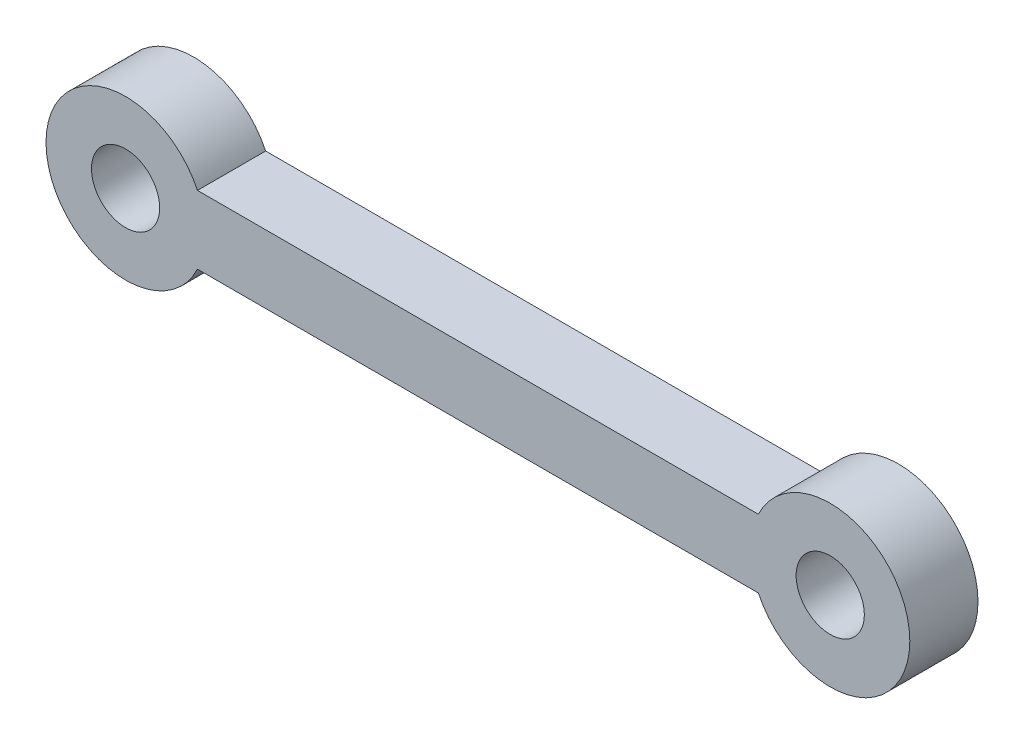
ISO-10303-21;
HEADER;
FILE_DESCRIPTION(('STEP AP214'),'2;1');
FILE_NAME('part.step','',(''),(''),'','','');
FILE_SCHEMA(('AUTOMOTIVE_DESIGN { 1 0 10303 214 1 1 1 1 }'));
ENDSEC;
DATA;
#1=APPLICATION_CONTEXT('core data for automotive mechanical design processes');
#2=APPLICATION_PROTOCOL_DEFINITION('international standard','automotive_design',2000,#1);
#3=PRODUCT_CONTEXT('',#1,'mechanical');
#4=PRODUCT('Part','Part','',(#3));
#5=PRODUCT_RELATED_PRODUCT_CATEGORY('part','',(#4));
#6=PRODUCT_DEFINITION_FORMATION('','',#4);
#7=PRODUCT_DEFINITION_CONTEXT('part definition',#1,'design');
#8=PRODUCT_DEFINITION('design','',#6,#7);
#9=PRODUCT_DEFINITION_SHAPE('','',#8);
#10=(LENGTH_UNIT() NAMED_UNIT(*) SI_UNIT(.MILLI.,.METRE.));
#11=(NAMED_UNIT(*) PLANE_ANGLE_UNIT() SI_UNIT($,.RADIAN.));
#12=(NAMED_UNIT(*) SI_UNIT($,.STERADIAN.) SOLID_ANGLE_UNIT());
#13=UNCERTAINTY_MEASURE_WITH_UNIT(LENGTH_MEASURE(1.E-05),#10,'distance_accuracy_value','');
#14=(GEOMETRIC_REPRESENTATION_CONTEXT(3) GLOBAL_UNCERTAINTY_ASSIGNED_CONTEXT((#13)) GLOBAL_UNIT_ASSIGNED_CONTEXT((#10,
#11,#12)) REPRESENTATION_CONTEXT('',''));
#15=CARTESIAN_POINT('',(0.,0.,0.));
#16=DIRECTION('',(0.,0.,1.));
#17=DIRECTION('',(1.,0.,0.));
#18=AXIS2_PLACEMENT_3D('',#15,#16,#17);
#19=CARTESIAN_POINT('',(31.,0.,3.));
#20=DIRECTION('',(0.,0.,-1.));
#21=DIRECTION('',(-1.,0.,0.));
#22=AXIS2_PLACEMENT_3D('',#19,#20,#21);
#23=CYLINDRICAL_SURFACE('',#22,3.5);
#24=CARTESIAN_POINT('',(31.,0.,0.));
#25=DIRECTION('',(0.,0.,1.));
#26=DIRECTION('',(1.,0.,0.));
#27=AXIS2_PLACEMENT_3D('',#24,#25,#26);
#28=CIRCLE('',#27,3.5);
#29=CARTESIAN_POINT('',(27.8377223398316,1.5,0.));
#30=VERTEX_POINT('',#29);
#31=CARTESIAN_POINT('',(27.8377223398316,-1.5,0.));
#32=VERTEX_POINT('',#31);
#33=EDGE_CURVE('E113',#30,#32,#28,.F.);
#34=ORIENTED_EDGE('',*,*,#33,.F.);
#35=DIRECTION('',(0.,0.,-1.));
#36=VECTOR('',#35,1.);
#37=CARTESIAN_POINT('',(27.8377223398316,1.5,3.));
#38=LINE('',#37,#36);
#39=CARTESIAN_POINT('',(27.8377223398316,1.5,3.));
#40=VERTEX_POINT('',#39);
#41=EDGE_CURVE('E11',#40,#30,#38,.T.);
#42=ORIENTED_EDGE('',*,*,#41,.F.);
#43=CARTESIAN_POINT('',(31.,0.,3.));
#44=DIRECTION('',(0.,0.,1.));
#45=DIRECTION('',(1.,0.,0.));
#46=AXIS2_PLACEMENT_3D('',#43,#44,#45);
#47=CIRCLE('',#46,3.5);
#48=CARTESIAN_POINT('',(27.8377223398316,-1.5,3.));
#49=VERTEX_POINT('',#48);
#50=EDGE_CURVE('E101',#40,#49,#47,.F.);
#51=ORIENTED_EDGE('',*,*,#50,.T.);
#52=DIRECTION('',(0.,0.,-1.));
#53=VECTOR('',#52,1.);
#54=CARTESIAN_POINT('',(27.8377223398316,-1.5,3.));
#55=LINE('',#54,#53);
#56=EDGE_CURVE('E81',#49,#32,#55,.T.);
#57=ORIENTED_EDGE('',*,*,#56,.T.);
#58=EDGE_LOOP('',(#34,#42,#51,#57));
#59=FACE_BOUND('',#58,.T.);
#60=ADVANCED_FACE('F43',(#59),#23,.T.);
#61=CARTESIAN_POINT('',(0.,1.5,3.));
#62=DIRECTION('',(0.,1.,0.));
#63=DIRECTION('',(0.,0.,1.));
#64=AXIS2_PLACEMENT_3D('',#61,#62,#63);
#65=PLANE('',#64);
#66=DIRECTION('',(1.,0.,0.));
#67=VECTOR('',#66,1.);
#68=CARTESIAN_POINT('',(0.,1.5,0.));
#69=LINE('',#68,#67);
#70=CARTESIAN_POINT('',(3.16227766016838,1.5,0.));
#71=VERTEX_POINT('',#70);
#72=EDGE_CURVE('E94',#71,#30,#69,.T.);
#73=ORIENTED_EDGE('',*,*,#72,.F.);
#74=DIRECTION('',(0.,0.,-1.));
#75=VECTOR('',#74,1.);
#76=CARTESIAN_POINT('',(3.16227766016838,1.5,3.));
#77=LINE('',#76,#75);
#78=CARTESIAN_POINT('',(3.16227766016838,1.5,3.));
#79=VERTEX_POINT('',#78);
#80=EDGE_CURVE('E51',#79,#71,#77,.T.);
#81=ORIENTED_EDGE('',*,*,#80,.F.);
#82=DIRECTION('',(1.,0.,0.));
#83=VECTOR('',#82,1.);
#84=CARTESIAN_POINT('',(0.,1.5,3.));
#85=LINE('',#84,#83);
#86=EDGE_CURVE('E92',#79,#40,#85,.T.);
#87=ORIENTED_EDGE('',*,*,#86,.T.);
#88=ORIENTED_EDGE('',*,*,#41,.T.);
#89=EDGE_LOOP('',(#73,#81,#87,#88));
#90=FACE_BOUND('',#89,.T.);
#91=ADVANCED_FACE('F90',(#90),#65,.T.);
#92=CARTESIAN_POINT('',(0.,0.,3.));
#93=DIRECTION('',(0.,0.,-1.));
#94=DIRECTION('',(-1.,0.,0.));
#95=AXIS2_PLACEMENT_3D('',#92,#93,#94);
#96=CYLINDRICAL_SURFACE('',#95,3.5);
#97=CARTESIAN_POINT('',(0.,0.,0.));
#98=DIRECTION('',(0.,0.,1.));
#99=DIRECTION('',(1.,0.,0.));
#100=AXIS2_PLACEMENT_3D('',#97,#98,#99);
#101=CIRCLE('',#100,3.5);
#102=CARTESIAN_POINT('',(3.16227766016838,-1.5,0.));
#103=VERTEX_POINT('',#102);
#104=EDGE_CURVE('E74',#71,#103,#101,.T.);
#105=ORIENTED_EDGE('',*,*,#104,.T.);
#106=DIRECTION('',(0.,0.,-1.));
#107=VECTOR('',#106,1.);
#108=CARTESIAN_POINT('',(3.16227766016838,-1.5,3.));
#109=LINE('',#108,#107);
#110=CARTESIAN_POINT('',(3.16227766016838,-1.5,3.));
#111=VERTEX_POINT('',#110);
#112=EDGE_CURVE('E95',#111,#103,#109,.T.);
#113=ORIENTED_EDGE('',*,*,#112,.F.);
#114=CARTESIAN_POINT('',(0.,0.,3.));
#115=DIRECTION('',(0.,0.,1.));
#116=DIRECTION('',(1.,0.,0.));
#117=AXIS2_PLACEMENT_3D('',#114,#115,#116);
#118=CIRCLE('',#117,3.5);
#119=EDGE_CURVE('E96',#79,#111,#118,.T.);
#120=ORIENTED_EDGE('',*,*,#119,.F.);
#121=ORIENTED_EDGE('',*,*,#80,.T.);
#122=EDGE_LOOP('',(#105,#113,#120,#121));
#123=FACE_BOUND('',#122,.T.);
#124=ADVANCED_FACE('F97',(#123),#96,.T.);
#125=CARTESIAN_POINT('',(31.,0.,3.));
#126=DIRECTION('',(0.,0.,-1.));
#127=DIRECTION('',(-1.,0.,0.));
#128=AXIS2_PLACEMENT_3D('',#125,#126,#127);
#129=CYLINDRICAL_SURFACE('',#128,1.5);
#130=CARTESIAN_POINT('',(31.,0.,3.));
#131=DIRECTION('',(0.,0.,1.));
#132=DIRECTION('',(1.,0.,0.));
#133=AXIS2_PLACEMENT_3D('',#130,#131,#132);
#134=CIRCLE('',#133,1.5);
#135=CARTESIAN_POINT('',(32.5,0.,3.));
#136=VERTEX_POINT('',#135);
#137=EDGE_CURVE('E107',#136,#136,#134,.F.);
#138=ORIENTED_EDGE('',*,*,#137,.F.);
#139=EDGE_LOOP('',(#138));
#140=FACE_BOUND('',#139,.T.);
#141=CARTESIAN_POINT('',(31.,0.,0.));
#142=DIRECTION('',(0.,0.,1.));
#143=DIRECTION('',(1.,0.,0.));
#144=AXIS2_PLACEMENT_3D('',#141,#142,#143);
#145=CIRCLE('',#144,1.5);
#146=CARTESIAN_POINT('',(32.5,0.,0.));
#147=VERTEX_POINT('',#146);
#148=EDGE_CURVE('E120',#147,#147,#145,.F.);
#149=ORIENTED_EDGE('',*,*,#148,.T.);
#150=EDGE_LOOP('',(#149));
#151=FACE_BOUND('',#150,.T.);
#152=ADVANCED_FACE('F139',(#140,#151),#129,.F.);
#153=CARTESIAN_POINT('',(0.,-1.5,3.));
#154=DIRECTION('',(0.,1.,0.));
#155=DIRECTION('',(0.,0.,1.));
#156=AXIS2_PLACEMENT_3D('',#153,#154,#155);
#157=PLANE('',#156);
#158=DIRECTION('',(1.,0.,0.));
#159=VECTOR('',#158,1.);
#160=CARTESIAN_POINT('',(0.,-1.5,0.));
#161=LINE('',#160,#159);
#162=EDGE_CURVE('E118',#103,#32,#161,.T.);
#163=ORIENTED_EDGE('',*,*,#162,.T.);
#164=ORIENTED_EDGE('',*,*,#56,.F.);
#165=DIRECTION('',(1.,0.,0.));
#166=VECTOR('',#165,1.);
#167=CARTESIAN_POINT('',(0.,-1.5,3.));
#168=LINE('',#167,#166);
#169=EDGE_CURVE('E59',#111,#49,#168,.T.);
#170=ORIENTED_EDGE('',*,*,#169,.F.);
#171=ORIENTED_EDGE('',*,*,#112,.T.);
#172=EDGE_LOOP('',(#163,#164,#170,#171));
#173=FACE_BOUND('',#172,.T.);
#174=ADVANCED_FACE('F128',(#173),#157,.F.);
#175=CARTESIAN_POINT('',(0.,0.,3.));
#176=DIRECTION('',(0.,0.,-1.));
#177=DIRECTION('',(-1.,0.,0.));
#178=AXIS2_PLACEMENT_3D('',#175,#176,#177);
#179=CYLINDRICAL_SURFACE('',#178,1.5);
#180=CARTESIAN_POINT('',(0.,0.,3.));
#181=DIRECTION('',(0.,0.,1.));
#182=DIRECTION('',(1.,0.,0.));
#183=AXIS2_PLACEMENT_3D('',#180,#181,#182);
#184=CIRCLE('',#183,1.5);
#185=CARTESIAN_POINT('',(1.5,0.,3.));
#186=VERTEX_POINT('',#185);
#187=EDGE_CURVE('E110',#186,#186,#184,.T.);
#188=ORIENTED_EDGE('',*,*,#187,.T.);
#189=EDGE_LOOP('',(#188));
#190=FACE_BOUND('',#189,.T.);
#191=CARTESIAN_POINT('',(0.,0.,0.));
#192=DIRECTION('',(0.,0.,1.));
#193=DIRECTION('',(1.,0.,0.));
#194=AXIS2_PLACEMENT_3D('',#191,#192,#193);
#195=CIRCLE('',#194,1.5);
#196=CARTESIAN_POINT('',(1.5,0.,0.));
#197=VERTEX_POINT('',#196);
#198=EDGE_CURVE('E103',#197,#197,#195,.T.);
#199=ORIENTED_EDGE('',*,*,#198,.F.);
#200=EDGE_LOOP('',(#199));
#201=FACE_BOUND('',#200,.T.);
#202=ADVANCED_FACE('F144',(#190,#201),#179,.F.);
#203=CARTESIAN_POINT('',(0.,0.,3.));
#204=DIRECTION('',(0.,0.,1.));
#205=DIRECTION('',(1.,0.,0.));
#206=AXIS2_PLACEMENT_3D('',#203,#204,#205);
#207=PLANE('',#206);
#208=ORIENTED_EDGE('',*,*,#50,.F.);
#209=ORIENTED_EDGE('',*,*,#86,.F.);
#210=ORIENTED_EDGE('',*,*,#119,.T.);
#211=ORIENTED_EDGE('',*,*,#169,.T.);
#212=EDGE_LOOP('',(#208,#209,#210,#211));
#213=FACE_BOUND('',#212,.T.);
#214=ORIENTED_EDGE('',*,*,#137,.T.);
#215=EDGE_LOOP('',(#214));
#216=FACE_BOUND('',#215,.T.);
#217=ORIENTED_EDGE('',*,*,#187,.F.);
#218=EDGE_LOOP('',(#217));
#219=FACE_BOUND('',#218,.T.);
#220=ADVANCED_FACE('F99',(#213,#216,#219),#207,.T.);
#221=CARTESIAN_POINT('',(0.,0.,0.));
#222=DIRECTION('',(0.,0.,1.));
#223=DIRECTION('',(1.,0.,0.));
#224=AXIS2_PLACEMENT_3D('',#221,#222,#223);
#225=PLANE('',#224);
#226=ORIENTED_EDGE('',*,*,#33,.T.);
#227=ORIENTED_EDGE('',*,*,#162,.F.);
#228=ORIENTED_EDGE('',*,*,#104,.F.);
#229=ORIENTED_EDGE('',*,*,#72,.T.);
#230=EDGE_LOOP('',(#226,#227,#228,#229));
#231=FACE_BOUND('',#230,.T.);
#232=ORIENTED_EDGE('',*,*,#148,.F.);
#233=EDGE_LOOP('',(#232));
#234=FACE_BOUND('',#233,.T.);
#235=ORIENTED_EDGE('',*,*,#198,.T.);
#236=EDGE_LOOP('',(#235));
#237=FACE_BOUND('',#236,.T.);
#238=ADVANCED_FACE('F130',(#231,#234,#237),#225,.F.);
#239=CLOSED_SHELL('',(#60,#91,#124,#152,#174,#202,#220,#238));
#240=MANIFOLD_SOLID_BREP('B2',#239);
#241=ADVANCED_BREP_SHAPE_REPRESENTATION('',(#18,#240),#14);
#242=SHAPE_DEFINITION_REPRESENTATION(#9,#241);
ENDSEC;
END-ISO-10303-21;
